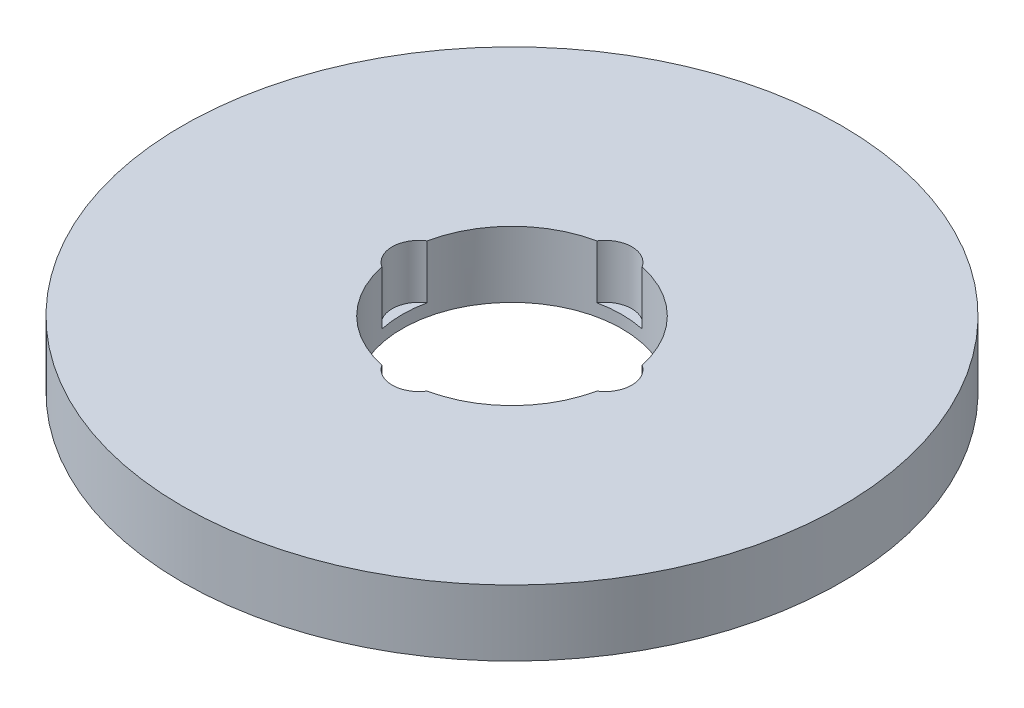
ISO-10303-21;
HEADER;
FILE_DESCRIPTION(('STEP AP214'),'2;1');
FILE_NAME('part.step','',(''),(''),'','','');
FILE_SCHEMA(('AUTOMOTIVE_DESIGN { 1 0 10303 214 1 1 1 1 }'));
ENDSEC;
DATA;
#1=APPLICATION_CONTEXT('core data for automotive mechanical design processes');
#2=APPLICATION_PROTOCOL_DEFINITION('international standard','automotive_design',2000,#1);
#3=PRODUCT_CONTEXT('',#1,'mechanical');
#4=PRODUCT('Part','Part','',(#3));
#5=PRODUCT_RELATED_PRODUCT_CATEGORY('part','',(#4));
#6=PRODUCT_DEFINITION_FORMATION('','',#4);
#7=PRODUCT_DEFINITION_CONTEXT('part definition',#1,'design');
#8=PRODUCT_DEFINITION('design','',#6,#7);
#9=PRODUCT_DEFINITION_SHAPE('','',#8);
#10=(LENGTH_UNIT() NAMED_UNIT(*) SI_UNIT(.MILLI.,.METRE.));
#11=(NAMED_UNIT(*) PLANE_ANGLE_UNIT() SI_UNIT($,.RADIAN.));
#12=(NAMED_UNIT(*) SI_UNIT($,.STERADIAN.) SOLID_ANGLE_UNIT());
#13=UNCERTAINTY_MEASURE_WITH_UNIT(LENGTH_MEASURE(1.E-05),#10,'distance_accuracy_value','');
#14=(GEOMETRIC_REPRESENTATION_CONTEXT(3) GLOBAL_UNCERTAINTY_ASSIGNED_CONTEXT((#13)) GLOBAL_UNIT_ASSIGNED_CONTEXT((#10,
#11,#12)) REPRESENTATION_CONTEXT('',''));
#15=CARTESIAN_POINT('',(0.,0.,0.));
#16=DIRECTION('',(0.,0.,1.));
#17=DIRECTION('',(1.,0.,0.));
#18=AXIS2_PLACEMENT_3D('',#15,#16,#17);
#19=CARTESIAN_POINT('',(0.,9.,0.));
#20=DIRECTION('',(0.,-1.,0.));
#21=DIRECTION('',(0.,0.,-1.));
#22=AXIS2_PLACEMENT_3D('',#19,#20,#21);
#23=CYLINDRICAL_SURFACE('',#22,45.);
#24=CARTESIAN_POINT('',(0.,9.,0.));
#25=DIRECTION('',(0.,1.,0.));
#26=DIRECTION('',(0.,0.,1.));
#27=AXIS2_PLACEMENT_3D('',#24,#25,#26);
#28=CIRCLE('',#27,45.);
#29=CARTESIAN_POINT('',(0.,9.,45.));
#30=VERTEX_POINT('',#29);
#31=EDGE_CURVE('E148',#30,#30,#28,.T.);
#32=ORIENTED_EDGE('',*,*,#31,.F.);
#33=EDGE_LOOP('',(#32));
#34=FACE_BOUND('',#33,.T.);
#35=CARTESIAN_POINT('',(0.,0.,0.));
#36=DIRECTION('',(0.,1.,0.));
#37=DIRECTION('',(0.,0.,1.));
#38=AXIS2_PLACEMENT_3D('',#35,#36,#37);
#39=CIRCLE('',#38,45.);
#40=CARTESIAN_POINT('',(0.,0.,45.));
#41=VERTEX_POINT('',#40);
#42=EDGE_CURVE('E139',#41,#41,#39,.T.);
#43=ORIENTED_EDGE('',*,*,#42,.T.);
#44=EDGE_LOOP('',(#43));
#45=FACE_BOUND('',#44,.T.);
#46=ADVANCED_FACE('F39',(#34,#45),#23,.T.);
#47=CARTESIAN_POINT('',(0.,9.,0.));
#48=DIRECTION('',(0.,1.,0.));
#49=DIRECTION('',(0.,0.,1.));
#50=AXIS2_PLACEMENT_3D('',#47,#48,#49);
#51=PLANE('',#50);
#52=CARTESIAN_POINT('',(0.,9.,12.6965079022139));
#53=DIRECTION('',(0.,1.,0.));
#54=DIRECTION('',(1.,0.,0.));
#55=AXIS2_PLACEMENT_3D('',#52,#53,#54);
#56=CIRCLE('',#55,3.66865894052826);
#57=CARTESIAN_POINT('',(-3.08691891464214,9.,14.678928149372));
#58=VERTEX_POINT('',#57);
#59=CARTESIAN_POINT('',(3.08691891464224,9.,14.6789281493719));
#60=VERTEX_POINT('',#59);
#61=EDGE_CURVE('E175',#58,#60,#56,.T.);
#62=ORIENTED_EDGE('',*,*,#61,.F.);
#63=CARTESIAN_POINT('',(0.,9.,0.));
#64=DIRECTION('',(0.,1.,0.));
#65=DIRECTION('',(0.,0.,1.));
#66=AXIS2_PLACEMENT_3D('',#63,#64,#65);
#67=CIRCLE('',#66,15.);
#68=CARTESIAN_POINT('',(-14.678928149372,9.,3.08691891464219));
#69=VERTEX_POINT('',#68);
#70=EDGE_CURVE('E134',#69,#58,#67,.T.);
#71=ORIENTED_EDGE('',*,*,#70,.F.);
#72=CARTESIAN_POINT('',(-12.6965079022139,9.,0.));
#73=DIRECTION('',(0.,1.,0.));
#74=DIRECTION('',(0.,0.,1.));
#75=AXIS2_PLACEMENT_3D('',#72,#73,#74);
#76=CIRCLE('',#75,3.66865894052826);
#77=CARTESIAN_POINT('',(-14.678928149372,9.,-3.08691891464219));
#78=VERTEX_POINT('',#77);
#79=EDGE_CURVE('E143',#78,#69,#76,.T.);
#80=ORIENTED_EDGE('',*,*,#79,.F.);
#81=CARTESIAN_POINT('',(-3.08691891464234,9.,-14.6789281493719));
#82=VERTEX_POINT('',#81);
#83=EDGE_CURVE('E123',#82,#78,#67,.T.);
#84=ORIENTED_EDGE('',*,*,#83,.F.);
#85=CARTESIAN_POINT('',(-1.32988861227162E-13,9.,-12.6965079022139));
#86=DIRECTION('',(0.,1.,0.));
#87=DIRECTION('',(-1.,0.,0.));
#88=AXIS2_PLACEMENT_3D('',#85,#86,#87);
#89=CIRCLE('',#88,3.66865894052826);
#90=CARTESIAN_POINT('',(3.08691891464203,9.,-14.678928149372));
#91=VERTEX_POINT('',#90);
#92=EDGE_CURVE('E106',#91,#82,#89,.T.);
#93=ORIENTED_EDGE('',*,*,#92,.F.);
#94=CARTESIAN_POINT('',(14.678928149372,9.,-3.08691891464219));
#95=VERTEX_POINT('',#94);
#96=EDGE_CURVE('E125',#95,#91,#67,.T.);
#97=ORIENTED_EDGE('',*,*,#96,.F.);
#98=CARTESIAN_POINT('',(12.6965079022139,9.,0.));
#99=DIRECTION('',(0.,1.,0.));
#100=DIRECTION('',(0.,0.,-1.));
#101=AXIS2_PLACEMENT_3D('',#98,#99,#100);
#102=CIRCLE('',#101,3.66865894052826);
#103=CARTESIAN_POINT('',(14.678928149372,9.,3.08691891464219));
#104=VERTEX_POINT('',#103);
#105=EDGE_CURVE('E286',#104,#95,#102,.T.);
#106=ORIENTED_EDGE('',*,*,#105,.F.);
#107=EDGE_CURVE('E135',#60,#104,#67,.T.);
#108=ORIENTED_EDGE('',*,*,#107,.F.);
#109=EDGE_LOOP('',(#62,#71,#80,#84,#93,#97,#106,#108));
#110=FACE_BOUND('',#109,.T.);
#111=ORIENTED_EDGE('',*,*,#31,.T.);
#112=EDGE_LOOP('',(#111));
#113=FACE_BOUND('',#112,.T.);
#114=ADVANCED_FACE('F118',(#110,#113),#51,.T.);
#115=CARTESIAN_POINT('',(0.,0.,0.));
#116=DIRECTION('',(0.,1.,0.));
#117=DIRECTION('',(0.,0.,1.));
#118=AXIS2_PLACEMENT_3D('',#115,#116,#117);
#119=PLANE('',#118);
#120=CARTESIAN_POINT('',(0.,0.,0.));
#121=DIRECTION('',(0.,1.,0.));
#122=DIRECTION('',(0.,0.,1.));
#123=AXIS2_PLACEMENT_3D('',#120,#121,#122);
#124=CIRCLE('',#123,15.);
#125=CARTESIAN_POINT('',(0.,0.,15.));
#126=VERTEX_POINT('',#125);
#127=EDGE_CURVE('E136',#126,#126,#124,.T.);
#128=ORIENTED_EDGE('',*,*,#127,.T.);
#129=EDGE_LOOP('',(#128));
#130=FACE_BOUND('',#129,.T.);
#131=ORIENTED_EDGE('',*,*,#42,.F.);
#132=EDGE_LOOP('',(#131));
#133=FACE_BOUND('',#132,.T.);
#134=ADVANCED_FACE('F187',(#130,#133),#119,.F.);
#135=CARTESIAN_POINT('',(0.,9.,0.));
#136=DIRECTION('',(0.,-1.,0.));
#137=DIRECTION('',(0.,0.,-1.));
#138=AXIS2_PLACEMENT_3D('',#135,#136,#137);
#139=CYLINDRICAL_SURFACE('',#138,15.);
#140=DIRECTION('',(0.,1.,0.));
#141=VECTOR('',#140,1.);
#142=CARTESIAN_POINT('',(-3.08691891464213,5.33510993048629,14.678928149372));
#143=LINE('',#142,#141);
#144=CARTESIAN_POINT('',(-3.08691891464214,1.67021986097258,14.678928149372));
#145=VERTEX_POINT('',#144);
#146=EDGE_CURVE('E11',#145,#58,#143,.T.);
#147=ORIENTED_EDGE('',*,*,#146,.F.);
#148=CARTESIAN_POINT('',(0.,1.67021986097258,0.));
#149=DIRECTION('',(0.,1.,0.));
#150=DIRECTION('',(0.,0.,1.));
#151=AXIS2_PLACEMENT_3D('',#148,#149,#150);
#152=CIRCLE('',#151,15.);
#153=CARTESIAN_POINT('',(3.08691891464224,1.67021986097258,14.6789281493719));
#154=VERTEX_POINT('',#153);
#155=EDGE_CURVE('E170',#145,#154,#152,.T.);
#156=ORIENTED_EDGE('',*,*,#155,.T.);
#157=DIRECTION('',(0.,1.,0.));
#158=VECTOR('',#157,1.);
#159=CARTESIAN_POINT('',(3.08691891464224,5.33510993048629,14.6789281493719));
#160=LINE('',#159,#158);
#161=EDGE_CURVE('E46',#60,#154,#160,.F.);
#162=ORIENTED_EDGE('',*,*,#161,.F.);
#163=ORIENTED_EDGE('',*,*,#107,.T.);
#164=DIRECTION('',(0.,1.,0.));
#165=VECTOR('',#164,1.);
#166=CARTESIAN_POINT('',(14.678928149372,5.33510993048629,3.08691891464218));
#167=LINE('',#166,#165);
#168=CARTESIAN_POINT('',(14.678928149372,1.67021986097258,3.08691891464219));
#169=VERTEX_POINT('',#168);
#170=EDGE_CURVE('E164',#169,#104,#167,.T.);
#171=ORIENTED_EDGE('',*,*,#170,.F.);
#172=CARTESIAN_POINT('',(0.,1.67021986097258,0.));
#173=DIRECTION('',(0.,1.,0.));
#174=DIRECTION('',(0.,0.,1.));
#175=AXIS2_PLACEMENT_3D('',#172,#173,#174);
#176=CIRCLE('',#175,15.);
#177=CARTESIAN_POINT('',(14.678928149372,1.67021986097258,-3.08691891464219));
#178=VERTEX_POINT('',#177);
#179=EDGE_CURVE('E115',#169,#178,#176,.T.);
#180=ORIENTED_EDGE('',*,*,#179,.T.);
#181=DIRECTION('',(0.,1.,0.));
#182=VECTOR('',#181,1.);
#183=CARTESIAN_POINT('',(14.678928149372,5.33510993048629,-3.08691891464218));
#184=LINE('',#183,#182);
#185=EDGE_CURVE('E131',#95,#178,#184,.F.);
#186=ORIENTED_EDGE('',*,*,#185,.F.);
#187=ORIENTED_EDGE('',*,*,#96,.T.);
#188=DIRECTION('',(0.,1.,0.));
#189=VECTOR('',#188,1.);
#190=CARTESIAN_POINT('',(3.08691891464203,5.33510993048629,-14.678928149372));
#191=LINE('',#190,#189);
#192=CARTESIAN_POINT('',(3.08691891464203,1.67021986097258,-14.678928149372));
#193=VERTEX_POINT('',#192);
#194=EDGE_CURVE('E105',#193,#91,#191,.T.);
#195=ORIENTED_EDGE('',*,*,#194,.F.);
#196=CARTESIAN_POINT('',(0.,1.67021986097258,0.));
#197=DIRECTION('',(0.,1.,0.));
#198=DIRECTION('',(0.,0.,1.));
#199=AXIS2_PLACEMENT_3D('',#196,#197,#198);
#200=CIRCLE('',#199,15.);
#201=CARTESIAN_POINT('',(-3.08691891464234,1.67021986097258,-14.6789281493719));
#202=VERTEX_POINT('',#201);
#203=EDGE_CURVE('E159',#193,#202,#200,.T.);
#204=ORIENTED_EDGE('',*,*,#203,.T.);
#205=DIRECTION('',(0.,1.,0.));
#206=VECTOR('',#205,1.);
#207=CARTESIAN_POINT('',(-3.08691891464234,5.33510993048629,-14.6789281493719));
#208=LINE('',#207,#206);
#209=EDGE_CURVE('E114',#82,#202,#208,.F.);
#210=ORIENTED_EDGE('',*,*,#209,.F.);
#211=ORIENTED_EDGE('',*,*,#83,.T.);
#212=DIRECTION('',(0.,1.,0.));
#213=VECTOR('',#212,1.);
#214=CARTESIAN_POINT('',(-14.678928149372,5.33510993048629,-3.08691891464218));
#215=LINE('',#214,#213);
#216=CARTESIAN_POINT('',(-14.678928149372,1.67021986097258,-3.08691891464219));
#217=VERTEX_POINT('',#216);
#218=EDGE_CURVE('E160',#217,#78,#215,.T.);
#219=ORIENTED_EDGE('',*,*,#218,.F.);
#220=CARTESIAN_POINT('',(0.,1.67021986097258,0.));
#221=DIRECTION('',(0.,1.,0.));
#222=DIRECTION('',(0.,0.,1.));
#223=AXIS2_PLACEMENT_3D('',#220,#221,#222);
#224=CIRCLE('',#223,15.);
#225=CARTESIAN_POINT('',(-14.678928149372,1.67021986097258,3.08691891464219));
#226=VERTEX_POINT('',#225);
#227=EDGE_CURVE('E149',#217,#226,#224,.T.);
#228=ORIENTED_EDGE('',*,*,#227,.T.);
#229=DIRECTION('',(0.,1.,0.));
#230=VECTOR('',#229,1.);
#231=CARTESIAN_POINT('',(-14.678928149372,5.33510993048629,3.08691891464218));
#232=LINE('',#231,#230);
#233=EDGE_CURVE('E152',#69,#226,#232,.F.);
#234=ORIENTED_EDGE('',*,*,#233,.F.);
#235=ORIENTED_EDGE('',*,*,#70,.T.);
#236=EDGE_LOOP('',(#147,#156,#162,#163,#171,#180,#186,#187,#195,#204,#210,#211,#219,#228,#234,#235));
#237=FACE_BOUND('',#236,.T.);
#238=ORIENTED_EDGE('',*,*,#127,.F.);
#239=EDGE_LOOP('',(#238));
#240=FACE_BOUND('',#239,.T.);
#241=ADVANCED_FACE('F126',(#237,#240),#139,.F.);
#242=CARTESIAN_POINT('',(-12.6965079022139,1.67021986097258,0.));
#243=DIRECTION('',(0.,1.,0.));
#244=DIRECTION('',(0.,0.,1.));
#245=AXIS2_PLACEMENT_3D('',#242,#243,#244);
#246=CYLINDRICAL_SURFACE('',#245,3.66865894052826);
#247=ORIENTED_EDGE('',*,*,#218,.T.);
#248=ORIENTED_EDGE('',*,*,#79,.T.);
#249=ORIENTED_EDGE('',*,*,#233,.T.);
#250=CARTESIAN_POINT('',(-12.6965079022139,1.67021986097258,0.));
#251=DIRECTION('',(0.,1.,0.));
#252=DIRECTION('',(0.,0.,1.));
#253=AXIS2_PLACEMENT_3D('',#250,#251,#252);
#254=CIRCLE('',#253,3.66865894052826);
#255=EDGE_CURVE('E144',#217,#226,#254,.T.);
#256=ORIENTED_EDGE('',*,*,#255,.F.);
#257=EDGE_LOOP('',(#247,#248,#249,#256));
#258=FACE_BOUND('',#257,.T.);
#259=ADVANCED_FACE('F200',(#258),#246,.F.);
#260=CARTESIAN_POINT('',(-12.6965079022139,1.67021986097258,0.));
#261=DIRECTION('',(0.,1.,0.));
#262=DIRECTION('',(0.,0.,1.));
#263=AXIS2_PLACEMENT_3D('',#260,#261,#262);
#264=PLANE('',#263);
#265=ORIENTED_EDGE('',*,*,#255,.T.);
#266=ORIENTED_EDGE('',*,*,#227,.F.);
#267=EDGE_LOOP('',(#265,#266));
#268=FACE_BOUND('',#267,.T.);
#269=ADVANCED_FACE('F201',(#268),#264,.T.);
#270=CARTESIAN_POINT('',(-1.32988861227162E-13,1.67021986097258,-12.6965079022139));
#271=DIRECTION('',(0.,1.,0.));
#272=DIRECTION('',(0.,0.,1.));
#273=AXIS2_PLACEMENT_3D('',#270,#271,#272);
#274=CYLINDRICAL_SURFACE('',#273,3.66865894052826);
#275=ORIENTED_EDGE('',*,*,#194,.T.);
#276=ORIENTED_EDGE('',*,*,#92,.T.);
#277=ORIENTED_EDGE('',*,*,#209,.T.);
#278=CARTESIAN_POINT('',(-1.32988861227162E-13,1.67021986097258,-12.6965079022139));
#279=DIRECTION('',(0.,1.,0.));
#280=DIRECTION('',(-1.,0.,0.));
#281=AXIS2_PLACEMENT_3D('',#278,#279,#280);
#282=CIRCLE('',#281,3.66865894052826);
#283=EDGE_CURVE('E107',#193,#202,#282,.T.);
#284=ORIENTED_EDGE('',*,*,#283,.F.);
#285=EDGE_LOOP('',(#275,#276,#277,#284));
#286=FACE_BOUND('',#285,.T.);
#287=ADVANCED_FACE('F102',(#286),#274,.F.);
#288=CARTESIAN_POINT('',(-1.32988861227162E-13,1.67021986097258,-12.6965079022139));
#289=DIRECTION('',(0.,1.,0.));
#290=DIRECTION('',(-1.,0.,0.));
#291=AXIS2_PLACEMENT_3D('',#288,#289,#290);
#292=PLANE('',#291);
#293=ORIENTED_EDGE('',*,*,#283,.T.);
#294=ORIENTED_EDGE('',*,*,#203,.F.);
#295=EDGE_LOOP('',(#293,#294));
#296=FACE_BOUND('',#295,.T.);
#297=ADVANCED_FACE('F209',(#296),#292,.T.);
#298=CARTESIAN_POINT('',(12.6965079022139,1.67021986097258,0.));
#299=DIRECTION('',(0.,1.,0.));
#300=DIRECTION('',(0.,0.,1.));
#301=AXIS2_PLACEMENT_3D('',#298,#299,#300);
#302=CYLINDRICAL_SURFACE('',#301,3.66865894052826);
#303=ORIENTED_EDGE('',*,*,#170,.T.);
#304=ORIENTED_EDGE('',*,*,#105,.T.);
#305=ORIENTED_EDGE('',*,*,#185,.T.);
#306=CARTESIAN_POINT('',(12.6965079022139,1.67021986097258,0.));
#307=DIRECTION('',(0.,1.,0.));
#308=DIRECTION('',(0.,0.,-1.));
#309=AXIS2_PLACEMENT_3D('',#306,#307,#308);
#310=CIRCLE('',#309,3.66865894052826);
#311=EDGE_CURVE('E56',#169,#178,#310,.T.);
#312=ORIENTED_EDGE('',*,*,#311,.F.);
#313=EDGE_LOOP('',(#303,#304,#305,#312));
#314=FACE_BOUND('',#313,.T.);
#315=ADVANCED_FACE('F213',(#314),#302,.F.);
#316=CARTESIAN_POINT('',(12.6965079022139,1.67021986097258,0.));
#317=DIRECTION('',(0.,1.,0.));
#318=DIRECTION('',(0.,0.,-1.));
#319=AXIS2_PLACEMENT_3D('',#316,#317,#318);
#320=PLANE('',#319);
#321=ORIENTED_EDGE('',*,*,#311,.T.);
#322=ORIENTED_EDGE('',*,*,#179,.F.);
#323=EDGE_LOOP('',(#321,#322));
#324=FACE_BOUND('',#323,.T.);
#325=ADVANCED_FACE('F179',(#324),#320,.T.);
#326=CARTESIAN_POINT('',(0.,1.67021986097258,12.6965079022139));
#327=DIRECTION('',(0.,1.,0.));
#328=DIRECTION('',(0.,0.,1.));
#329=AXIS2_PLACEMENT_3D('',#326,#327,#328);
#330=CYLINDRICAL_SURFACE('',#329,3.66865894052826);
#331=ORIENTED_EDGE('',*,*,#146,.T.);
#332=ORIENTED_EDGE('',*,*,#61,.T.);
#333=ORIENTED_EDGE('',*,*,#161,.T.);
#334=CARTESIAN_POINT('',(0.,1.67021986097258,12.6965079022139));
#335=DIRECTION('',(0.,1.,0.));
#336=DIRECTION('',(1.,0.,0.));
#337=AXIS2_PLACEMENT_3D('',#334,#335,#336);
#338=CIRCLE('',#337,3.66865894052826);
#339=EDGE_CURVE('E55',#145,#154,#338,.T.);
#340=ORIENTED_EDGE('',*,*,#339,.F.);
#341=EDGE_LOOP('',(#331,#332,#333,#340));
#342=FACE_BOUND('',#341,.T.);
#343=ADVANCED_FACE('F171',(#342),#330,.F.);
#344=CARTESIAN_POINT('',(0.,1.67021986097258,12.6965079022139));
#345=DIRECTION('',(0.,1.,0.));
#346=DIRECTION('',(1.,0.,0.));
#347=AXIS2_PLACEMENT_3D('',#344,#345,#346);
#348=PLANE('',#347);
#349=ORIENTED_EDGE('',*,*,#339,.T.);
#350=ORIENTED_EDGE('',*,*,#155,.F.);
#351=EDGE_LOOP('',(#349,#350));
#352=FACE_BOUND('',#351,.T.);
#353=ADVANCED_FACE('F173',(#352),#348,.T.);
#354=CLOSED_SHELL('',(#46,#114,#134,#241,#259,#269,#287,#297,#315,#325,#343,#353));
#355=MANIFOLD_SOLID_BREP('B2',#354);
#356=ADVANCED_BREP_SHAPE_REPRESENTATION('',(#18,#355),#14);
#357=SHAPE_DEFINITION_REPRESENTATION(#9,#356);
ENDSEC;
END-ISO-10303-21;
